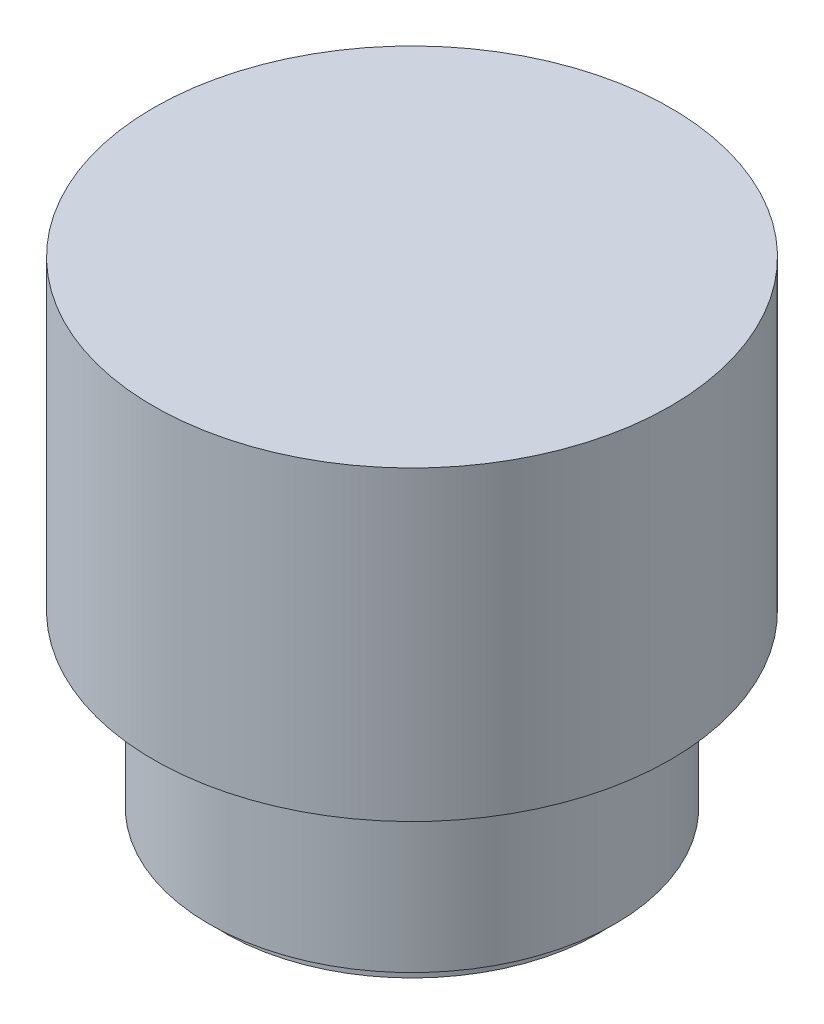
ISO-10303-21;
HEADER;
FILE_DESCRIPTION(('STEP AP214'),'2;1');
FILE_NAME('part.step','',(''),(''),'','','');
FILE_SCHEMA(('AUTOMOTIVE_DESIGN { 1 0 10303 214 1 1 1 1 }'));
ENDSEC;
DATA;
#1=APPLICATION_CONTEXT('core data for automotive mechanical design processes');
#2=APPLICATION_PROTOCOL_DEFINITION('international standard','automotive_design',2000,#1);
#3=PRODUCT_CONTEXT('',#1,'mechanical');
#4=PRODUCT('Part','Part','',(#3));
#5=PRODUCT_RELATED_PRODUCT_CATEGORY('part','',(#4));
#6=PRODUCT_DEFINITION_FORMATION('','',#4);
#7=PRODUCT_DEFINITION_CONTEXT('part definition',#1,'design');
#8=PRODUCT_DEFINITION('design','',#6,#7);
#9=PRODUCT_DEFINITION_SHAPE('','',#8);
#10=(LENGTH_UNIT() NAMED_UNIT(*) SI_UNIT(.MILLI.,.METRE.));
#11=(NAMED_UNIT(*) PLANE_ANGLE_UNIT() SI_UNIT($,.RADIAN.));
#12=(NAMED_UNIT(*) SI_UNIT($,.STERADIAN.) SOLID_ANGLE_UNIT());
#13=UNCERTAINTY_MEASURE_WITH_UNIT(LENGTH_MEASURE(1.E-05),#10,'distance_accuracy_value','');
#14=(GEOMETRIC_REPRESENTATION_CONTEXT(3) GLOBAL_UNCERTAINTY_ASSIGNED_CONTEXT((#13)) GLOBAL_UNIT_ASSIGNED_CONTEXT((#10,
#11,#12)) REPRESENTATION_CONTEXT('',''));
#15=CARTESIAN_POINT('',(0.,0.,0.));
#16=DIRECTION('',(0.,0.,1.));
#17=DIRECTION('',(1.,0.,0.));
#18=AXIS2_PLACEMENT_3D('',#15,#16,#17);
#19=CARTESIAN_POINT('',(1.46158824139451E-12,-426.088089193896,0.));
#20=DIRECTION('',(0.,-1.,0.));
#21=DIRECTION('',(1.,0.,0.));
#22=AXIS2_PLACEMENT_3D('',#19,#20,#21);
#23=CYLINDRICAL_SURFACE('',#22,32.4999999999999);
#24=CARTESIAN_POINT('',(0.,23.4000000000001,0.));
#25=DIRECTION('',(0.,-1.,0.));
#26=DIRECTION('',(1.,0.,0.));
#27=AXIS2_PLACEMENT_3D('',#24,#25,#26);
#28=CIRCLE('',#27,32.4999999999999);
#29=CARTESIAN_POINT('',(32.4999999999998,23.4000000000002,0.));
#30=VERTEX_POINT('',#29);
#31=EDGE_CURVE('E103',#30,#30,#28,.T.);
#32=ORIENTED_EDGE('',*,*,#31,.F.);
#33=EDGE_LOOP('',(#32));
#34=FACE_BOUND('',#33,.T.);
#35=CARTESIAN_POINT('',(-2.12332413031029E-13,61.9000000000001,0.));
#36=DIRECTION('',(0.,-1.,0.));
#37=DIRECTION('',(1.,0.,0.));
#38=AXIS2_PLACEMENT_3D('',#35,#36,#37);
#39=CIRCLE('',#38,32.4999999999998);
#40=CARTESIAN_POINT('',(32.4999999999996,61.9000000000002,0.));
#41=VERTEX_POINT('',#40);
#42=EDGE_CURVE('E66',#41,#41,#39,.T.);
#43=ORIENTED_EDGE('',*,*,#42,.T.);
#44=EDGE_LOOP('',(#43));
#45=FACE_BOUND('',#44,.T.);
#46=CARTESIAN_POINT('',(9.10117987628585,36.8180469600175,-31.1996565027216));
#47=CARTESIAN_POINT('',(8.97444744300858,36.93689250463,-31.2366255768154));
#48=CARTESIAN_POINT('',(8.85222350861118,37.0611947221042,-31.2714399523793));
#49=CARTESIAN_POINT('',(8.61781792393339,37.3199558743392,-31.3368474571301));
#50=CARTESIAN_POINT('',(8.50563535881718,37.4544138817775,-31.3674409710036));
#51=CARTESIAN_POINT('',(8.2923018195085,37.7325723004786,-31.4245115913373));
#52=CARTESIAN_POINT('',(8.19114782497271,37.8762701640397,-31.4509898256796));
#53=CARTESIAN_POINT('',(8.00069997574731,38.1719711506832,-31.4999757332363));
#54=CARTESIAN_POINT('',(7.91140649361161,38.3239745344411,-31.5224832817336));
#55=CARTESIAN_POINT('',(7.7454175129535,38.635278561517,-31.5636789254559));
#56=CARTESIAN_POINT('',(7.66872660868346,38.7945818390562,-31.5823656284006));
#57=CARTESIAN_POINT('',(7.52860910310954,39.1193616261684,-31.6160598841845));
#58=CARTESIAN_POINT('',(7.46518717311381,39.2848402856908,-31.6310661416515));
#59=CARTESIAN_POINT('',(7.35219263638669,39.6206838196618,-31.657520946223));
#60=CARTESIAN_POINT('',(7.30261607492916,39.7910472834754,-31.6689705093503));
#61=CARTESIAN_POINT('',(7.21768681925356,40.1355431594629,-31.688434771072));
#62=CARTESIAN_POINT('',(7.18233937913161,40.3096769388598,-31.6964482009471));
#63=CARTESIAN_POINT('',(7.12639458710702,40.659103950691,-31.7090731068646));
#64=CARTESIAN_POINT('',(7.10569072701656,40.8343792528021,-31.7137091554229));
#65=CARTESIAN_POINT('',(7.07877688045605,41.1861599354662,-31.7197274430876));
#66=CARTESIAN_POINT('',(7.07257222384551,41.3626657444438,-31.7211084856661));
#67=CARTESIAN_POINT('',(7.07472249739101,41.7155139122924,-31.7206289764132));
#68=CARTESIAN_POINT('',(7.08307164575726,41.8918563082383,-31.7187697118585));
#69=CARTESIAN_POINT('',(7.11425633850161,42.2432562577674,-31.7117897852069));
#70=CARTESIAN_POINT('',(7.13709722667269,42.4183133132865,-31.7066679200313));
#71=CARTESIAN_POINT('',(7.19703102638054,42.7655210520723,-31.6931173101599));
#72=CARTESIAN_POINT('',(7.23409867784785,42.9376763251864,-31.6846944259715));
#73=CARTESIAN_POINT('',(7.32220201048479,43.2782383297093,-31.6644500850102));
#74=CARTESIAN_POINT('',(7.37324282316261,43.4466436593714,-31.6526273796053));
#75=CARTESIAN_POINT('',(7.48885337120653,43.7784105051804,-31.6254738633815));
#76=CARTESIAN_POINT('',(7.55342007732233,43.9417731413024,-31.6101438379889));
#77=CARTESIAN_POINT('',(7.69555481950386,44.262347264277,-31.5758416699004));
#78=CARTESIAN_POINT('',(7.77312310219462,44.4195586343774,-31.5568694581155));
#79=CARTESIAN_POINT('',(7.94071034284731,44.7269134809781,-31.5151167042173));
#80=CARTESIAN_POINT('',(8.03074391426727,44.8770483804719,-31.4923316855898));
#81=CARTESIAN_POINT('',(8.22243328886289,45.1690235694564,-31.4428272544223));
#82=CARTESIAN_POINT('',(8.32408934266214,45.3108636799813,-31.416107757037));
#83=CARTESIAN_POINT('',(8.53813783152335,45.5852683016831,-31.3586108400308));
#84=CARTESIAN_POINT('',(8.65052793665023,45.7178348150146,-31.3278343004832));
#85=CARTESIAN_POINT('',(8.88514772308753,45.9729178764235,-31.262101625041));
#86=CARTESIAN_POINT('',(9.00738081664156,46.0954309093111,-31.2271440376575));
#87=CARTESIAN_POINT('',(9.26173424177217,46.3306343180416,-31.1526558648121));
#88=CARTESIAN_POINT('',(9.39393111464588,46.4432303114029,-31.1130882555695));
#89=CARTESIAN_POINT('',(9.66614925046855,46.6567769543581,-31.029597046263));
#90=CARTESIAN_POINT('',(9.80617334163058,46.7577233536935,-30.9856718671766));
#91=CARTESIAN_POINT('',(10.236175688983,47.0421872451383,-30.8473812818754));
#92=CARTESIAN_POINT('',(10.5363270512732,47.2075524351679,-30.7464309535408));
#93=CARTESIAN_POINT('',(11.1636007737478,47.4913407225581,-30.524387909662));
#94=CARTESIAN_POINT('',(11.4912788834145,47.6080920977422,-30.4027539534866));
#95=CARTESIAN_POINT('',(12.1551665942238,47.7865521211756,-30.143473148644));
#96=CARTESIAN_POINT('',(12.4913785906279,47.8482451361474,-30.0058217645196));
#97=CARTESIAN_POINT('',(13.1864690142337,47.9201782430032,-29.7072316946603));
#98=CARTESIAN_POINT('',(13.5453286224954,47.9266200600769,-29.5453448962397));
#99=CARTESIAN_POINT('',(14.2538201695698,47.8809674124038,-29.2101427333456));
#100=CARTESIAN_POINT('',(14.6034488582112,47.8288526041511,-29.0368234167293));
#101=CARTESIAN_POINT('',(15.3178990517199,47.6620227406197,-28.6668524210239));
#102=CARTESIAN_POINT('',(15.6811172434653,47.5419447806753,-28.4695284989743));
#103=CARTESIAN_POINT('',(16.3803386185783,47.2396883772011,-28.0730488032478));
#104=CARTESIAN_POINT('',(16.7163159491102,47.0574517766855,-27.8738914846157));
#105=CARTESIAN_POINT('',(17.2038188353936,46.7335800596709,-27.5738722660336));
#106=CARTESIAN_POINT('',(17.3680867621788,46.6128516006034,-27.4706242498508));
#107=CARTESIAN_POINT('',(17.685613586375,46.3551593831893,-27.2672793622561));
#108=CARTESIAN_POINT('',(17.8388709331128,46.2181933451965,-27.1671829358086));
#109=CARTESIAN_POINT('',(18.132827956206,45.9286633337795,-26.9718683948192));
#110=CARTESIAN_POINT('',(18.2735431098438,45.7761190975251,-26.8766443313149));
#111=CARTESIAN_POINT('',(18.5412217770455,45.4557132683328,-26.6926853856316));
#112=CARTESIAN_POINT('',(18.6681849479137,45.2878512938731,-26.6039506651833));
#113=CARTESIAN_POINT('',(18.8755679180079,44.9831990139066,-26.4570336407738));
#114=CARTESIAN_POINT('',(18.9594936319927,44.849713976104,-26.3969162964246));
#115=CARTESIAN_POINT('',(19.1181717361683,44.5751211291077,-26.2822199921765));
#116=CARTESIAN_POINT('',(19.1929252929408,44.4340142926045,-26.2276403281085));
#117=CARTESIAN_POINT('',(19.3324435866102,44.1447454215847,-26.1249713822805));
#118=CARTESIAN_POINT('',(19.3972126649587,43.9965864903464,-26.0768792807408));
#119=CARTESIAN_POINT('',(19.5159636027411,43.6939127246837,-25.9881254034378));
#120=CARTESIAN_POINT('',(19.5699499809814,43.5394005856322,-25.9474605156967));
#121=CARTESIAN_POINT('',(19.6667831003705,43.2235401530755,-25.8741447999619));
#122=CARTESIAN_POINT('',(19.7095310805481,43.0621448552095,-25.8415651548093));
#123=CARTESIAN_POINT('',(19.7825407758475,42.7349588328811,-25.7857169786996));
#124=CARTESIAN_POINT('',(19.8128025071016,42.5691681140978,-25.7624484357126));
#125=CARTESIAN_POINT('',(19.8602404133081,42.2347472410947,-25.7258965117535));
#126=CARTESIAN_POINT('',(19.8774256752706,42.06611914205,-25.7126061968653));
#127=CARTESIAN_POINT('',(19.8983859373248,41.7275440043896,-25.6963892278707));
#128=CARTESIAN_POINT('',(19.9021627244449,41.5575971445589,-25.6934611927208));
#129=CARTESIAN_POINT('',(19.8966269517706,41.2405179373246,-25.6977476327738));
#130=CARTESIAN_POINT('',(19.8889762493992,41.0933349919917,-25.7036744151371));
#131=CARTESIAN_POINT('',(19.863640414715,40.8003036144781,-25.7232588821961));
#132=CARTESIAN_POINT('',(19.8459520012046,40.6544556345293,-25.7369190948465));
#133=CARTESIAN_POINT('',(19.8008161571051,40.3652305012136,-25.7716605264529));
#134=CARTESIAN_POINT('',(19.7733717384707,40.2218525995714,-25.7927394550216));
#135=CARTESIAN_POINT('',(19.7091047924332,39.9383854770602,-25.8418811690475));
#136=CARTESIAN_POINT('',(19.6722785753713,39.7982975738051,-25.869946702086));
#137=CARTESIAN_POINT('',(19.5898813839814,39.5227570448847,-25.9323968298029));
#138=CARTESIAN_POINT('',(19.5443431475028,39.3872892351733,-25.96675774797));
#139=CARTESIAN_POINT('',(19.4449535460247,39.1210573673073,-26.0412680110076));
#140=CARTESIAN_POINT('',(19.3910993080386,38.9902949540824,-26.0814193560189));
#141=CARTESIAN_POINT('',(19.2178812889262,38.6059073750145,-26.2096100888348));
#142=CARTESIAN_POINT('',(19.0868161888375,38.3600306172682,-26.3054215208735));
#143=CARTESIAN_POINT('',(18.7759678438656,37.8567447690408,-26.5283770221575));
#144=CARTESIAN_POINT('',(18.5918173899942,37.6031949427275,-26.658067508661));
#145=CARTESIAN_POINT('',(18.1933575286559,37.1296835657968,-26.9315854702993));
#146=CARTESIAN_POINT('',(17.9790278282945,36.9097448249152,-27.0754224379156));
#147=CARTESIAN_POINT('',(17.480813995396,36.4658858925866,-27.400280487229));
#148=CARTESIAN_POINT('',(17.1914834254492,36.2493527106216,-27.5831287004829));
#149=CARTESIAN_POINT('',(16.7352784511077,35.9638848509403,-27.8605894720859));
#150=CARTESIAN_POINT('',(16.5794004616165,35.8752395835445,-27.9536691113747));
#151=CARTESIAN_POINT('',(16.2608573583729,35.7113300796705,-28.1401582343843));
#152=CARTESIAN_POINT('',(16.0981913168275,35.6360676798116,-28.2335677615868));
#153=CARTESIAN_POINT('',(15.7471387087848,35.4911860626901,-28.4310196911723));
#154=CARTESIAN_POINT('',(15.5579978773939,35.423309536375,-28.5350019905775));
#155=CARTESIAN_POINT('',(15.1734403678021,35.3054353298035,-28.741334339456));
#156=CARTESIAN_POINT('',(14.9780257465319,35.2554318536099,-28.8436849077679));
#157=CARTESIAN_POINT('',(14.5819920201288,35.1738763690747,-29.0459113047071));
#158=CARTESIAN_POINT('',(14.3813703791516,35.1423335341774,-29.1457858794005));
#159=CARTESIAN_POINT('',(13.9764853204655,35.0983876218073,-29.342093378939));
#160=CARTESIAN_POINT('',(13.7722236897877,35.0859754006292,-29.4385279264422));
#161=CARTESIAN_POINT('',(13.364213844962,35.0809059960894,-29.6259602775505));
#162=CARTESIAN_POINT('',(13.1604941941193,35.0879912071229,-29.7170128946352));
#163=CARTESIAN_POINT('',(12.7526856099574,35.1218715825038,-29.8942873131116));
#164=CARTESIAN_POINT('',(12.5485968911733,35.148657623651,-29.9805113306826));
#165=CARTESIAN_POINT('',(12.1418387078521,35.2223047807746,-30.1475386121774));
#166=CARTESIAN_POINT('',(11.9391690830832,35.2691635919089,-30.2283424972326));
#167=CARTESIAN_POINT('',(11.5372692342153,35.3831461157791,-30.3840064420358));
#168=CARTESIAN_POINT('',(11.3380387452308,35.4502682603855,-30.4588669611604));
#169=CARTESIAN_POINT('',(10.9564373839669,35.6002982064421,-30.5981267004246));
#170=CARTESIAN_POINT('',(10.7737539955494,35.6820834409493,-30.6628793763939));
#171=CARTESIAN_POINT('',(10.4152931649866,35.8633290289625,-30.7864841714398));
#172=CARTESIAN_POINT('',(10.2395150821195,35.9627877378496,-30.8453368387499));
#173=CARTESIAN_POINT('',(9.89689059993786,36.1787876746883,-30.9569702881595));
#174=CARTESIAN_POINT('',(9.73003914082881,36.2953190823852,-31.0097545298874));
#175=CARTESIAN_POINT('',(9.4070863197293,36.5447094947973,-31.1092476281227));
#176=CARTESIAN_POINT('',(9.25098338910133,36.6775661091017,-31.1559573720289));
#177=CARTESIAN_POINT('',(9.10117987628585,36.8180469600175,-31.1996565027216));
#178=B_SPLINE_CURVE_WITH_KNOTS('',3,(#46,#47,#48,#49,#50,#51,#52,#53,#54,#55,#56,#57,#58,#59,
#60,#61,#62,#63,#64,#65,#66,#67,#68,#69,#70,#71,#72,#73,#74,#75,#76,#77,#78,#79,#80,#81,#82,#83,
#84,#85,#86,#87,#88,#89,#90,#91,#92,#93,#94,#95,#96,#97,#98,#99,#100,#101,#102,#103,#104,#105,
#106,#107,#108,#109,#110,#111,#112,#113,#114,#115,#116,#117,#118,#119,#120,#121,#122,#123,#124,
#125,#126,#127,#128,#129,#130,#131,#132,#133,#134,#135,#136,#137,#138,#139,#140,#141,#142,#143,
#144,#145,#146,#147,#148,#149,#150,#151,#152,#153,#154,#155,#156,#157,#158,#159,#160,#161,#162,
#163,#164,#165,#166,#167,#168,#169,#170,#171,#172,#173,#174,#175,#176,#177),.UNSPECIFIED.,.T.,
.F.,(4,2,2,2,2,2,2,2,2,2,2,2,2,2,2,2,2,2,2,2,2,2,2,2,2,2,2,2,2,2,2,2,2,2,2,2,2,2,2,2,2,2,2,2,2,
2,2,2,2,2,2,2,2,2,2,2,2,2,2,2,2,2,2,2,2,4),(0.,0.53270638269816,1.06536418278136,
1.59787573796985,2.13040401607525,2.66312599802166,3.19603520895793,3.72879204615633,
4.26174542350739,4.79078142138877,5.32001186059185,5.84903210034303,6.37824752845771,
6.90652763247895,7.43500200310733,7.96335814325089,8.49172430684057,9.02071522029344,
9.5497175428941,10.0786052999989,10.6076772011768,11.1413366373398,11.6751901633063,
12.7418978952845,13.8427447483053,14.9439040765606,16.1202036045731,17.2969119242005,
18.5828722722669,19.8700391084806,20.5548716585551,21.2398004685986,21.9238720115946,
22.6079605975453,23.1137436697559,23.6194623459716,24.1249605015065,24.6302463666732,
25.139834433719,25.6494218423717,26.1586548078241,26.6678199021799,27.1097806623902,
27.551885977137,27.9938549198462,28.4359979484485,28.8765110254432,29.3171766314379,
30.1980266701677,31.2118065399114,32.226271372146,33.4360625904248,34.0417431010974,
34.6475066692694,35.3254938766063,36.003261023913,36.6813646812876,37.3591441303001,
38.0280117141499,38.6965697489227,39.3650510375431,40.0334806072961,40.6636755939139,
41.2938119679297,41.9235872988637,42.5532705248838),.UNSPECIFIED.);
#179=CARTESIAN_POINT('',(9.10117987628585,36.8180469600175,-31.1996565027216));
#180=VERTEX_POINT('',#179);
#181=EDGE_CURVE('E60',#180,#180,#178,.T.);
#182=ORIENTED_EDGE('',*,*,#181,.F.);
#183=EDGE_LOOP('',(#182));
#184=FACE_BOUND('',#183,.T.);
#185=CARTESIAN_POINT('',(-14.918359654621,35.2447403102292,-28.8737345214534));
#186=CARTESIAN_POINT('',(-15.3132716823804,35.3351945435733,-28.6696876665965));
#187=CARTESIAN_POINT('',(-15.6973541967746,35.4625664787659,-28.4609004758644));
#188=CARTESIAN_POINT('',(-16.4348541417601,35.7866396277422,-28.0414993619274));
#189=CARTESIAN_POINT('',(-16.7882344931591,35.9834232588271,-27.8308835587285));
#190=CARTESIAN_POINT('',(-17.2884255716857,36.3276375761989,-27.5208888554561));
#191=CARTESIAN_POINT('',(-17.4504190891538,36.4507933564333,-27.4183808396946));
#192=CARTESIAN_POINT('',(-17.7632529028757,36.7131794302386,-27.2167480136014));
#193=CARTESIAN_POINT('',(-17.914092008369,36.8524114359336,-27.11762356508));
#194=CARTESIAN_POINT('',(-18.2030168188647,37.1462630563832,-26.9245308138772));
#195=CARTESIAN_POINT('',(-18.3411219647663,37.3008584401012,-26.8305547432981));
#196=CARTESIAN_POINT('',(-18.6034155256877,37.6251801721779,-26.6493587721229));
#197=CARTESIAN_POINT('',(-18.7276037562896,37.7949067209916,-26.5621389610612));
#198=CARTESIAN_POINT('',(-18.9294706094327,38.1017993835813,-26.4184817353219));
#199=CARTESIAN_POINT('',(-19.0107490530354,38.2356627689545,-26.3600152806979));
#200=CARTESIAN_POINT('',(-19.1641472803537,38.5107783457665,-26.2487034828072));
#201=CARTESIAN_POINT('',(-19.2362682634256,38.6520295661891,-26.1958574035852));
#202=CARTESIAN_POINT('',(-19.3705528272782,38.9413371598715,-26.0967172642198));
#203=CARTESIAN_POINT('',(-19.4327205673113,39.0893906571404,-26.0504204682145));
#204=CARTESIAN_POINT('',(-19.5463210104728,39.3915821114124,-25.9652917510997));
#205=CARTESIAN_POINT('',(-19.5977581679076,39.5457175120715,-25.9264567331082));
#206=CARTESIAN_POINT('',(-19.689539185451,39.8604820534155,-25.8568249995762));
#207=CARTESIAN_POINT('',(-19.7297885681151,40.0211540965662,-25.8260968484616));
#208=CARTESIAN_POINT('',(-19.7979333607482,40.3465877600961,-25.7738953910574));
#209=CARTESIAN_POINT('',(-19.8258287978702,40.5113493714861,-25.7524220644265));
#210=CARTESIAN_POINT('',(-19.8687176702171,40.8434254946974,-25.7193467092222));
#211=CARTESIAN_POINT('',(-19.8837192035406,41.0107383368931,-25.7077384848601));
#212=CARTESIAN_POINT('',(-19.9005397984048,41.346412453511,-25.6947199746924));
#213=CARTESIAN_POINT('',(-19.9023604766176,41.5147735968205,-25.693308438232));
#214=CARTESIAN_POINT('',(-19.8933992472372,41.8295007147927,-25.7002467244565));
#215=CARTESIAN_POINT('',(-19.8841898838678,41.9759422133131,-25.707378551161));
#216=CARTESIAN_POINT('',(-19.8558498658937,42.2673357965244,-25.7292741461039));
#217=CARTESIAN_POINT('',(-19.8367159565448,42.4122873766847,-25.7440404180451));
#218=CARTESIAN_POINT('',(-19.7888203097924,42.6995948808484,-25.7808746775437));
#219=CARTESIAN_POINT('',(-19.760061413904,42.8419515578623,-25.8029405100826));
#220=CARTESIAN_POINT('',(-19.6933061059144,43.1232787302777,-25.8539253583618));
#221=CARTESIAN_POINT('',(-19.6553060634034,43.2622478712118,-25.882847067339));
#222=CARTESIAN_POINT('',(-19.5703962042832,43.5365012449151,-25.9471083794168));
#223=CARTESIAN_POINT('',(-19.5234538716425,43.6717699027412,-25.9824713831799));
#224=CARTESIAN_POINT('',(-19.4212791535066,43.9374890147592,-26.0589329945138));
#225=CARTESIAN_POINT('',(-19.3660438909809,44.0679377771571,-26.1000335922548));
#226=CARTESIAN_POINT('',(-19.1887259266341,44.4512372412192,-26.2309811278274));
#227=CARTESIAN_POINT('',(-19.0549851043506,44.6961870328063,-26.328509043955));
#228=CARTESIAN_POINT('',(-18.7379815408034,45.1979959439942,-26.5552542102322));
#229=CARTESIAN_POINT('',(-18.5502595040019,45.4508434758901,-26.6870395574147));
#230=CARTESIAN_POINT('',(-18.144635043555,45.9223805651498,-26.9644722046899));
#231=CARTESIAN_POINT('',(-17.9267121828293,46.141046776768,-27.1101288705308));
#232=CARTESIAN_POINT('',(-17.420787416387,46.5813411340133,-27.4385367196427));
#233=CARTESIAN_POINT('',(-17.1273611299032,46.7954932552717,-27.6230443253511));
#234=CARTESIAN_POINT('',(-16.6650954312908,47.0767801733332,-27.9026404481498));
#235=CARTESIAN_POINT('',(-16.5072098910783,47.1639290066634,-27.9963731355057));
#236=CARTESIAN_POINT('',(-16.1846898022378,47.3246292108114,-28.1840477815785));
#237=CARTESIAN_POINT('',(-16.0200543329201,47.3981787190933,-28.27798976718));
#238=CARTESIAN_POINT('',(-15.6656516672382,47.5388838573221,-28.4760102869932));
#239=CARTESIAN_POINT('',(-15.4751674651716,47.6043391405391,-28.5800158954247));
#240=CARTESIAN_POINT('',(-15.0880735898512,47.7172156656637,-28.7862485482602));
#241=CARTESIAN_POINT('',(-14.8914659698271,47.7646428835639,-28.8884761712943));
#242=CARTESIAN_POINT('',(-14.4932190888661,47.8408815281494,-29.0903155029984));
#243=CARTESIAN_POINT('',(-14.2915773626951,47.8696836406185,-29.1899258789606));
#244=CARTESIAN_POINT('',(-13.8848593499326,47.9079834439622,-29.385567411313));
#245=CARTESIAN_POINT('',(-13.6797847760978,47.9174904883893,-29.4816002797752));
#246=CARTESIAN_POINT('',(-13.2713131633672,47.9166304489191,-29.6676882678928));
#247=CARTESIAN_POINT('',(-13.0679499635697,47.9066096392998,-29.7578187735371));
#248=CARTESIAN_POINT('',(-12.6611237049351,47.866896595017,-29.9331752555296));
#249=CARTESIAN_POINT('',(-12.4576607377309,47.8372135929991,-30.0184035133896));
#250=CARTESIAN_POINT('',(-12.052472858487,47.7578450950022,-30.1833684796254));
#251=CARTESIAN_POINT('',(-11.8507474499633,47.7081655204593,-30.2631068055155));
#252=CARTESIAN_POINT('',(-11.4510272116722,47.5886478968946,-30.4166039520466));
#253=CARTESIAN_POINT('',(-11.2530319709302,47.5188120826045,-30.4903634344043));
#254=CARTESIAN_POINT('',(-10.8812522274604,47.3665780782586,-30.6248870036579));
#255=CARTESIAN_POINT('',(-10.7069385783486,47.285972231943,-30.6862211051173));
#256=CARTESIAN_POINT('',(-10.3648488126318,47.1085686444357,-30.8034510045469));
#257=CARTESIAN_POINT('',(-10.1970720597748,47.0117724839648,-30.8593473325855));
#258=CARTESIAN_POINT('',(-9.8698138210931,46.802513181304,-30.9655674756129));
#259=CARTESIAN_POINT('',(-9.7103292661441,46.6900558931527,-31.0158933602433));
#260=CARTESIAN_POINT('',(-9.401274736901,46.4501563714049,-31.1109655047651));
#261=CARTESIAN_POINT('',(-9.25170416276523,46.3227150457085,-31.1557121023737));
#262=CARTESIAN_POINT('',(-8.97574200087384,46.0646687211155,-31.2362773755264));
#263=CARTESIAN_POINT('',(-8.84845417214874,45.9351543929586,-31.2725255080984));
#264=CARTESIAN_POINT('',(-8.60479859457528,45.6651256973228,-31.3404441377122));
#265=CARTESIAN_POINT('',(-8.48843018728919,45.5246119940413,-31.3721149108295));
#266=CARTESIAN_POINT('',(-8.26771448186352,45.2336062784884,-31.4310029721574));
#267=CARTESIAN_POINT('',(-8.16336510282171,45.0831160006312,-31.4582210316279));
#268=CARTESIAN_POINT('',(-7.96763570323607,44.7732468062661,-31.5083638606513));
#269=CARTESIAN_POINT('',(-7.87625552152172,44.6138680002518,-31.5312886835579));
#270=CARTESIAN_POINT('',(-7.71043791933637,44.2934741651131,-31.5722373485569));
#271=CARTESIAN_POINT('',(-7.6354989207554,44.1327375960514,-31.5904110784614));
#272=CARTESIAN_POINT('',(-7.49904822726651,43.8052350337124,-31.6230802238779));
#273=CARTESIAN_POINT('',(-7.43754107388614,43.6384670232525,-31.637574395539));
#274=CARTESIAN_POINT('',(-7.32853125276595,43.3002289618927,-31.663003076084));
#275=CARTESIAN_POINT('',(-7.28102273440398,43.1287609081843,-31.6739390722796));
#276=CARTESIAN_POINT('',(-7.20035902328735,42.7822324827346,-31.6923736056298));
#277=CARTESIAN_POINT('',(-7.16720912254466,42.6071708113849,-31.6998708754674));
#278=CARTESIAN_POINT('',(-7.11582480947421,42.2565646960081,-31.7114446901164));
#279=CARTESIAN_POINT('',(-7.09744356442082,42.0810428642963,-31.7155549202949));
#280=CARTESIAN_POINT('',(-7.07518771153792,41.7289709263943,-31.7205272626422));
#281=CARTESIAN_POINT('',(-7.07131842104156,41.5524204670307,-31.721388184231));
#282=CARTESIAN_POINT('',(-7.07813146329674,41.1996826663524,-31.7198686455598));
#283=CARTESIAN_POINT('',(-7.08880820376223,41.0234952115551,-31.7174894309847));
#284=CARTESIAN_POINT('',(-7.12462331524371,40.6726055430201,-31.7094635500456));
#285=CARTESIAN_POINT('',(-7.14976701968403,40.4979039011626,-31.7038156786465));
#286=CARTESIAN_POINT('',(-7.21426205234858,40.1515814195084,-31.6892018298067));
#287=CARTESIAN_POINT('',(-7.2535900212167,39.9799559986135,-31.6802413072019));
#288=CARTESIAN_POINT('',(-7.3461553122206,39.6406472482361,-31.6589048521924));
#289=CARTESIAN_POINT('',(-7.39939774349487,39.472965391461,-31.6465276651564));
#290=CARTESIAN_POINT('',(-7.51933281829213,39.1428328148114,-31.6182451442178));
#291=CARTESIAN_POINT('',(-7.58602245095779,38.9803809333598,-31.6023406000187));
#292=CARTESIAN_POINT('',(-7.73230654295485,38.661807855081,-31.5668670635372));
#293=CARTESIAN_POINT('',(-7.81190125121632,38.5056867804433,-31.5472980005676));
#294=CARTESIAN_POINT('',(-7.98344145610028,38.2006619575595,-31.5043248870337));
#295=CARTESIAN_POINT('',(-8.07540316095029,38.051768035783,-31.480915794711));
#296=CARTESIAN_POINT('',(-8.27082051132151,37.7624350625222,-31.4301402420223));
#297=CARTESIAN_POINT('',(-8.37427640515009,37.6219961937924,-31.4027736961602));
#298=CARTESIAN_POINT('',(-8.59177956147944,37.3505404817364,-31.3439628338054));
#299=CARTESIAN_POINT('',(-8.70582447240512,37.219521557872,-31.3125194220782));
#300=CARTESIAN_POINT('',(-8.94359650792075,36.9676636989892,-31.2454372186571));
#301=CARTESIAN_POINT('',(-9.06732699049068,36.8468283250205,-31.2097969697443));
#302=CARTESIAN_POINT('',(-9.32459092130859,36.6150411796742,-31.1339064540289));
#303=CARTESIAN_POINT('',(-9.45820437088138,36.5041910264223,-31.0936166410397));
#304=CARTESIAN_POINT('',(-9.7330836011076,36.2942425145627,-31.0086737033971));
#305=CARTESIAN_POINT('',(-9.87435214962766,36.1951484484856,-30.9640189957668));
#306=CARTESIAN_POINT('',(-10.3078282180572,35.9163625195484,-30.8235380296771));
#307=CARTESIAN_POINT('',(-10.6099413702143,35.7549566661324,-30.7211267749519));
#308=CARTESIAN_POINT('',(-11.2408735572552,35.4792132657574,-30.4960441082913));
#309=CARTESIAN_POINT('',(-11.5702472139479,35.366624945441,-30.3728109289981));
#310=CARTESIAN_POINT('',(-12.2367673105975,35.1966824635171,-30.1104599765862));
#311=CARTESIAN_POINT('',(-12.5739147933922,35.1393357570833,-29.9713400622942));
#312=CARTESIAN_POINT('',(-13.2510639336603,35.0781599742244,-29.6782239895987));
#313=CARTESIAN_POINT('',(-13.5910543800303,35.0749476908478,-29.5240764844656));
#314=CARTESIAN_POINT('',(-14.2625854691833,35.1210941694987,-29.2055987004413));
#315=CARTESIAN_POINT('',(-14.5941226502816,35.1704741253886,-29.0412643415479));
#316=CARTESIAN_POINT('',(-14.918359654621,35.2447403102292,-28.8737345214534));
#317=B_SPLINE_CURVE_WITH_KNOTS('',3,(#185,#186,#187,#188,#189,#190,#191,#192,#193,#194,#195,
#196,#197,#198,#199,#200,#201,#202,#203,#204,#205,#206,#207,#208,#209,#210,#211,#212,#213,#214,
#215,#216,#217,#218,#219,#220,#221,#222,#223,#224,#225,#226,#227,#228,#229,#230,#231,#232,#233,
#234,#235,#236,#237,#238,#239,#240,#241,#242,#243,#244,#245,#246,#247,#248,#249,#250,#251,#252,
#253,#254,#255,#256,#257,#258,#259,#260,#261,#262,#263,#264,#265,#266,#267,#268,#269,#270,#271,
#272,#273,#274,#275,#276,#277,#278,#279,#280,#281,#282,#283,#284,#285,#286,#287,#288,#289,#290,
#291,#292,#293,#294,#295,#296,#297,#298,#299,#300,#301,#302,#303,#304,#305,#306,#307,#308,#309,
#310,#311,#312,#313,#314,#315,#316),.UNSPECIFIED.,.T.,.F.,(4,2,2,2,2,2,2,2,2,2,2,2,2,2,2,2,2,2,
2,2,2,2,2,2,2,2,2,2,2,2,2,2,2,2,2,2,2,2,2,2,2,2,2,2,2,2,2,2,2,2,2,2,2,2,2,2,2,2,2,2,2,2,2,2,2,
4),(0.,1.35956975563032,2.72075928680869,3.40361674895086,4.08654700287029,4.76841674041007,
5.45029551257462,5.95133159662929,6.45230199195852,6.95306249272541,7.45361471043075,
7.95827371112024,8.46293160260957,8.96727230840584,9.47155115423182,9.91172919880049,
10.3520516906348,10.7922443037475,11.2326101278865,11.6746088826877,12.116761334068,
13.0005999406375,14.0210548699106,15.0422037501315,16.2592089465236,16.8685000037005,
17.4778744464369,18.1571269790982,18.8361541545111,19.5155206420869,20.1945577185756,
20.8616633937817,21.5284560424285,22.1950513838188,22.8615728478413,23.4655863727239,
24.0695409598917,24.6732703952789,25.2769632688377,25.8318008846249,26.386605022347,
26.9413129597722,27.4960140031399,28.0302022530217,28.5645708420326,29.0987157779733,
29.6330574112006,30.1620183997093,30.6911731861766,31.2201245941385,31.7492711316084,
32.2775501936267,32.8060235033447,33.3343786178804,33.8627439252369,34.3918085841988,
34.9208846746946,35.4498435494124,35.9789866329692,36.51301799432,37.0472437516652,
38.1147385891403,39.2178339992238,40.3210782575348,41.4368841923945,42.5531399500556),.UNSPECIFIED.);
#318=CARTESIAN_POINT('',(-14.918359654621,35.2447403102292,-28.8737345214534));
#319=VERTEX_POINT('',#318);
#320=EDGE_CURVE('E43',#319,#319,#317,.T.);
#321=ORIENTED_EDGE('',*,*,#320,.F.);
#322=EDGE_LOOP('',(#321));
#323=FACE_BOUND('',#322,.T.);
#324=ADVANCED_FACE('F39',(#34,#45,#184,#323),#23,.T.);
#325=CARTESIAN_POINT('',(0.,0.,0.));
#326=DIRECTION('',(0.,1.,0.));
#327=DIRECTION('',(-1.,0.,0.));
#328=AXIS2_PLACEMENT_3D('',#325,#326,#327);
#329=PLANE('',#328);
#330=CARTESIAN_POINT('',(15.,0.,15.));
#331=DIRECTION('',(0.,-1.,0.));
#332=DIRECTION('',(1.,0.,0.));
#333=AXIS2_PLACEMENT_3D('',#330,#331,#332);
#334=CIRCLE('',#333,1.25);
#335=CARTESIAN_POINT('',(16.25,0.,15.));
#336=VERTEX_POINT('',#335);
#337=EDGE_CURVE('E287',#336,#336,#334,.T.);
#338=ORIENTED_EDGE('',*,*,#337,.F.);
#339=EDGE_LOOP('',(#338));
#340=FACE_BOUND('',#339,.T.);
#341=CARTESIAN_POINT('',(15.,0.,-15.));
#342=DIRECTION('',(0.,-1.,0.));
#343=DIRECTION('',(1.,0.,0.));
#344=AXIS2_PLACEMENT_3D('',#341,#342,#343);
#345=CIRCLE('',#344,1.25);
#346=CARTESIAN_POINT('',(16.25,0.,-15.));
#347=VERTEX_POINT('',#346);
#348=EDGE_CURVE('E295',#347,#347,#345,.T.);
#349=ORIENTED_EDGE('',*,*,#348,.F.);
#350=EDGE_LOOP('',(#349));
#351=FACE_BOUND('',#350,.T.);
#352=CARTESIAN_POINT('',(-15.,0.,-15.));
#353=DIRECTION('',(0.,-1.,0.));
#354=DIRECTION('',(1.,0.,0.));
#355=AXIS2_PLACEMENT_3D('',#352,#353,#354);
#356=CIRCLE('',#355,1.25);
#357=CARTESIAN_POINT('',(-13.75,0.,-15.));
#358=VERTEX_POINT('',#357);
#359=EDGE_CURVE('E301',#358,#358,#356,.T.);
#360=ORIENTED_EDGE('',*,*,#359,.F.);
#361=EDGE_LOOP('',(#360));
#362=FACE_BOUND('',#361,.T.);
#363=CARTESIAN_POINT('',(-15.,0.,15.));
#364=DIRECTION('',(0.,-1.,0.));
#365=DIRECTION('',(1.,0.,0.));
#366=AXIS2_PLACEMENT_3D('',#363,#364,#365);
#367=CIRCLE('',#366,1.25);
#368=CARTESIAN_POINT('',(-13.75,0.,15.));
#369=VERTEX_POINT('',#368);
#370=EDGE_CURVE('E120',#369,#369,#367,.T.);
#371=ORIENTED_EDGE('',*,*,#370,.F.);
#372=EDGE_LOOP('',(#371));
#373=FACE_BOUND('',#372,.T.);
#374=CARTESIAN_POINT('',(0.,0.,0.));
#375=DIRECTION('',(0.,-1.,0.));
#376=DIRECTION('',(1.,0.,0.));
#377=AXIS2_PLACEMENT_3D('',#374,#375,#376);
#378=CIRCLE('',#377,23.5);
#379=CARTESIAN_POINT('',(23.5,1.36122002705073E-13,0.));
#380=VERTEX_POINT('',#379);
#381=EDGE_CURVE('E10',#380,#380,#378,.T.);
#382=ORIENTED_EDGE('',*,*,#381,.T.);
#383=EDGE_LOOP('',(#382));
#384=FACE_BOUND('',#383,.T.);
#385=ADVANCED_FACE('F41',(#340,#351,#362,#373,#384),#329,.F.);
#386=CARTESIAN_POINT('',(1.46158824139451E-12,-426.088089193896,0.));
#387=DIRECTION('',(0.,-1.,0.));
#388=DIRECTION('',(1.,0.,0.));
#389=AXIS2_PLACEMENT_3D('',#386,#387,#388);
#390=CYLINDRICAL_SURFACE('',#389,23.5);
#391=ORIENTED_EDGE('',*,*,#381,.F.);
#392=EDGE_LOOP('',(#391));
#393=FACE_BOUND('',#392,.T.);
#394=CARTESIAN_POINT('',(0.,2.00000000000006,0.));
#395=DIRECTION('',(0.,-1.,0.));
#396=DIRECTION('',(1.,0.,0.));
#397=AXIS2_PLACEMENT_3D('',#394,#395,#396);
#398=CIRCLE('',#397,23.5);
#399=CARTESIAN_POINT('',(23.5,2.00000000000014,0.));
#400=VERTEX_POINT('',#399);
#401=EDGE_CURVE('E52',#400,#400,#398,.T.);
#402=ORIENTED_EDGE('',*,*,#401,.T.);
#403=EDGE_LOOP('',(#402));
#404=FACE_BOUND('',#403,.T.);
#405=ADVANCED_FACE('F98',(#393,#404),#390,.T.);
#406=CARTESIAN_POINT('',(-23.5,2.,0.));
#407=DIRECTION('',(0.,1.,0.));
#408=DIRECTION('',(-1.,0.,0.));
#409=AXIS2_PLACEMENT_3D('',#406,#407,#408);
#410=PLANE('',#409);
#411=ORIENTED_EDGE('',*,*,#401,.F.);
#412=EDGE_LOOP('',(#411));
#413=FACE_BOUND('',#412,.T.);
#414=CARTESIAN_POINT('',(0.,2.00000000000011,0.));
#415=DIRECTION('',(0.,-1.,0.));
#416=DIRECTION('',(1.,0.,0.));
#417=AXIS2_PLACEMENT_3D('',#414,#415,#416);
#418=CIRCLE('',#417,25.5);
#419=CARTESIAN_POINT('',(25.5,2.0000000000002,0.));
#420=VERTEX_POINT('',#419);
#421=EDGE_CURVE('E57',#420,#420,#418,.T.);
#422=ORIENTED_EDGE('',*,*,#421,.T.);
#423=EDGE_LOOP('',(#422));
#424=FACE_BOUND('',#423,.T.);
#425=ADVANCED_FACE('F131',(#413,#424),#410,.F.);
#426=CARTESIAN_POINT('',(1.46158824139451E-12,-426.088089193896,0.));
#427=DIRECTION('',(0.,-1.,0.));
#428=DIRECTION('',(1.,0.,0.));
#429=AXIS2_PLACEMENT_3D('',#426,#427,#428);
#430=CYLINDRICAL_SURFACE('',#429,25.5);
#431=ORIENTED_EDGE('',*,*,#421,.F.);
#432=EDGE_LOOP('',(#431));
#433=FACE_BOUND('',#432,.T.);
#434=CARTESIAN_POINT('',(0.,23.4000000000001,0.));
#435=DIRECTION('',(0.,-1.,0.));
#436=DIRECTION('',(1.,0.,0.));
#437=AXIS2_PLACEMENT_3D('',#434,#435,#436);
#438=CIRCLE('',#437,25.4999999999999);
#439=CARTESIAN_POINT('',(25.4999999999998,23.4000000000002,0.));
#440=VERTEX_POINT('',#439);
#441=EDGE_CURVE('E126',#440,#440,#438,.T.);
#442=ORIENTED_EDGE('',*,*,#441,.T.);
#443=EDGE_LOOP('',(#442));
#444=FACE_BOUND('',#443,.T.);
#445=ADVANCED_FACE('F89',(#433,#444),#430,.T.);
#446=CARTESIAN_POINT('',(-25.5,23.4,0.));
#447=DIRECTION('',(0.,1.,0.));
#448=DIRECTION('',(-1.,0.,0.));
#449=AXIS2_PLACEMENT_3D('',#446,#447,#448);
#450=PLANE('',#449);
#451=ORIENTED_EDGE('',*,*,#441,.F.);
#452=EDGE_LOOP('',(#451));
#453=FACE_BOUND('',#452,.T.);
#454=ORIENTED_EDGE('',*,*,#31,.T.);
#455=EDGE_LOOP('',(#454));
#456=FACE_BOUND('',#455,.T.);
#457=ADVANCED_FACE('F84',(#453,#456),#450,.F.);
#458=CARTESIAN_POINT('',(-32.5,61.8999999999999,0.));
#459=DIRECTION('',(0.,-1.,0.));
#460=DIRECTION('',(1.,0.,0.));
#461=AXIS2_PLACEMENT_3D('',#458,#459,#460);
#462=PLANE('',#461);
#463=ORIENTED_EDGE('',*,*,#42,.F.);
#464=EDGE_LOOP('',(#463));
#465=FACE_BOUND('',#464,.T.);
#466=ADVANCED_FACE('F77',(#465),#462,.F.);
#467=CARTESIAN_POINT('',(13.4999999999999,41.5000000000001,-32.5));
#468=DIRECTION('',(0.,0.,-1.));
#469=DIRECTION('',(-1.,0.,0.));
#470=AXIS2_PLACEMENT_3D('',#467,#468,#469);
#471=CONICAL_SURFACE('',#470,6.42987114787033,0.00436332312997903);
#472=CARTESIAN_POINT('',(13.4999999999999,41.5000000000001,-14.1949974566546));
#473=DIRECTION('',(0.,0.,1.));
#474=DIRECTION('',(1.,0.,0.));
#475=AXIS2_PLACEMENT_3D('',#472,#473,#474);
#476=CIRCLE('',#475,6.35);
#477=CARTESIAN_POINT('',(19.8499999999999,41.5000000000001,-14.1949974566546));
#478=VERTEX_POINT('',#477);
#479=EDGE_CURVE('E67',#478,#478,#476,.T.);
#480=ORIENTED_EDGE('',*,*,#479,.T.);
#481=EDGE_LOOP('',(#480));
#482=FACE_BOUND('',#481,.T.);
#483=ORIENTED_EDGE('',*,*,#181,.T.);
#484=EDGE_LOOP('',(#483));
#485=FACE_BOUND('',#484,.T.);
#486=ADVANCED_FACE('F71',(#482,#485),#471,.F.);
#487=CARTESIAN_POINT('',(19.8499999999999,41.5000000000001,-14.1949974566546));
#488=DIRECTION('',(0.,0.,-1.));
#489=DIRECTION('',(-1.,0.,0.));
#490=AXIS2_PLACEMENT_3D('',#487,#488,#489);
#491=PLANE('',#490);
#492=ORIENTED_EDGE('',*,*,#479,.F.);
#493=EDGE_LOOP('',(#492));
#494=FACE_BOUND('',#493,.T.);
#495=ADVANCED_FACE('F76',(#494),#491,.T.);
#496=CARTESIAN_POINT('',(-13.4999999999999,41.5000000000001,-32.5));
#497=DIRECTION('',(0.,0.,-1.));
#498=DIRECTION('',(1.,0.,0.));
#499=AXIS2_PLACEMENT_3D('',#496,#497,#498);
#500=CONICAL_SURFACE('',#499,6.42987114787033,0.00436332312997903);
#501=CARTESIAN_POINT('',(-13.4999999999999,41.5000000000001,-14.1949974566546));
#502=DIRECTION('',(0.,0.,-1.));
#503=DIRECTION('',(-1.,0.,0.));
#504=AXIS2_PLACEMENT_3D('',#501,#502,#503);
#505=CIRCLE('',#504,6.35);
#506=CARTESIAN_POINT('',(-19.8499999999999,41.5000000000001,-14.1949974566546));
#507=VERTEX_POINT('',#506);
#508=EDGE_CURVE('E111',#507,#507,#505,.T.);
#509=ORIENTED_EDGE('',*,*,#508,.F.);
#510=EDGE_LOOP('',(#509));
#511=FACE_BOUND('',#510,.T.);
#512=ORIENTED_EDGE('',*,*,#320,.T.);
#513=EDGE_LOOP('',(#512));
#514=FACE_BOUND('',#513,.T.);
#515=ADVANCED_FACE('F81',(#511,#514),#500,.F.);
#516=CARTESIAN_POINT('',(-19.8499999999999,41.5000000000001,-14.1949974566546));
#517=DIRECTION('',(0.,0.,-1.));
#518=DIRECTION('',(1.,0.,0.));
#519=AXIS2_PLACEMENT_3D('',#516,#517,#518);
#520=PLANE('',#519);
#521=ORIENTED_EDGE('',*,*,#508,.T.);
#522=EDGE_LOOP('',(#521));
#523=FACE_BOUND('',#522,.T.);
#524=ADVANCED_FACE('F79',(#523),#520,.T.);
#525=CARTESIAN_POINT('',(-15.,7.99999999999995,15.));
#526=DIRECTION('',(0.,-1.,0.));
#527=DIRECTION('',(1.,0.,0.));
#528=AXIS2_PLACEMENT_3D('',#525,#526,#527);
#529=CYLINDRICAL_SURFACE('',#528,1.25);
#530=CARTESIAN_POINT('',(-15.,7.99999999999995,15.));
#531=DIRECTION('',(0.,-1.,0.));
#532=DIRECTION('',(1.,0.,0.));
#533=AXIS2_PLACEMENT_3D('',#530,#531,#532);
#534=CIRCLE('',#533,1.25);
#535=CARTESIAN_POINT('',(-13.75,7.99999999999995,15.));
#536=VERTEX_POINT('',#535);
#537=EDGE_CURVE('E115',#536,#536,#534,.T.);
#538=ORIENTED_EDGE('',*,*,#537,.F.);
#539=EDGE_LOOP('',(#538));
#540=FACE_BOUND('',#539,.T.);
#541=ORIENTED_EDGE('',*,*,#370,.T.);
#542=EDGE_LOOP('',(#541));
#543=FACE_BOUND('',#542,.T.);
#544=ADVANCED_FACE('F202',(#540,#543),#529,.F.);
#545=CARTESIAN_POINT('',(-15.,7.99999999999995,15.));
#546=DIRECTION('',(0.,-1.,0.));
#547=DIRECTION('',(1.,0.,0.));
#548=AXIS2_PLACEMENT_3D('',#545,#546,#547);
#549=PLANE('',#548);
#550=ORIENTED_EDGE('',*,*,#537,.T.);
#551=EDGE_LOOP('',(#550));
#552=FACE_BOUND('',#551,.T.);
#553=ADVANCED_FACE('F210',(#552),#549,.T.);
#554=CARTESIAN_POINT('',(-15.,7.99999999999995,-15.));
#555=DIRECTION('',(0.,-1.,0.));
#556=DIRECTION('',(1.,0.,0.));
#557=AXIS2_PLACEMENT_3D('',#554,#555,#556);
#558=CYLINDRICAL_SURFACE('',#557,1.25);
#559=CARTESIAN_POINT('',(-15.,7.99999999999995,-15.));
#560=DIRECTION('',(0.,-1.,0.));
#561=DIRECTION('',(1.,0.,0.));
#562=AXIS2_PLACEMENT_3D('',#559,#560,#561);
#563=CIRCLE('',#562,1.25);
#564=CARTESIAN_POINT('',(-13.75,7.99999999999995,-15.));
#565=VERTEX_POINT('',#564);
#566=EDGE_CURVE('E298',#565,#565,#563,.T.);
#567=ORIENTED_EDGE('',*,*,#566,.F.);
#568=EDGE_LOOP('',(#567));
#569=FACE_BOUND('',#568,.T.);
#570=ORIENTED_EDGE('',*,*,#359,.T.);
#571=EDGE_LOOP('',(#570));
#572=FACE_BOUND('',#571,.T.);
#573=ADVANCED_FACE('F220',(#569,#572),#558,.F.);
#574=CARTESIAN_POINT('',(-15.,7.99999999999995,-15.));
#575=DIRECTION('',(0.,-1.,0.));
#576=DIRECTION('',(1.,0.,0.));
#577=AXIS2_PLACEMENT_3D('',#574,#575,#576);
#578=PLANE('',#577);
#579=ORIENTED_EDGE('',*,*,#566,.T.);
#580=EDGE_LOOP('',(#579));
#581=FACE_BOUND('',#580,.T.);
#582=ADVANCED_FACE('F230',(#581),#578,.T.);
#583=CARTESIAN_POINT('',(15.,8.00000000000005,-15.));
#584=DIRECTION('',(0.,-1.,0.));
#585=DIRECTION('',(1.,0.,0.));
#586=AXIS2_PLACEMENT_3D('',#583,#584,#585);
#587=CYLINDRICAL_SURFACE('',#586,1.25);
#588=CARTESIAN_POINT('',(15.,8.00000000000005,-15.));
#589=DIRECTION('',(0.,-1.,0.));
#590=DIRECTION('',(1.,0.,0.));
#591=AXIS2_PLACEMENT_3D('',#588,#589,#590);
#592=CIRCLE('',#591,1.25);
#593=CARTESIAN_POINT('',(16.25,8.00000000000006,-15.));
#594=VERTEX_POINT('',#593);
#595=EDGE_CURVE('E290',#594,#594,#592,.T.);
#596=ORIENTED_EDGE('',*,*,#595,.F.);
#597=EDGE_LOOP('',(#596));
#598=FACE_BOUND('',#597,.T.);
#599=ORIENTED_EDGE('',*,*,#348,.T.);
#600=EDGE_LOOP('',(#599));
#601=FACE_BOUND('',#600,.T.);
#602=ADVANCED_FACE('F240',(#598,#601),#587,.F.);
#603=CARTESIAN_POINT('',(15.,8.00000000000005,-15.));
#604=DIRECTION('',(0.,-1.,0.));
#605=DIRECTION('',(1.,0.,0.));
#606=AXIS2_PLACEMENT_3D('',#603,#604,#605);
#607=PLANE('',#606);
#608=ORIENTED_EDGE('',*,*,#595,.T.);
#609=EDGE_LOOP('',(#608));
#610=FACE_BOUND('',#609,.T.);
#611=ADVANCED_FACE('F250',(#610),#607,.T.);
#612=CARTESIAN_POINT('',(15.,8.00000000000005,15.));
#613=DIRECTION('',(0.,-1.,0.));
#614=DIRECTION('',(1.,0.,0.));
#615=AXIS2_PLACEMENT_3D('',#612,#613,#614);
#616=CYLINDRICAL_SURFACE('',#615,1.25);
#617=CARTESIAN_POINT('',(15.,8.00000000000005,15.));
#618=DIRECTION('',(0.,-1.,0.));
#619=DIRECTION('',(1.,0.,0.));
#620=AXIS2_PLACEMENT_3D('',#617,#618,#619);
#621=CIRCLE('',#620,1.25);
#622=CARTESIAN_POINT('',(16.25,8.00000000000006,15.));
#623=VERTEX_POINT('',#622);
#624=EDGE_CURVE('E286',#623,#623,#621,.T.);
#625=ORIENTED_EDGE('',*,*,#624,.F.);
#626=EDGE_LOOP('',(#625));
#627=FACE_BOUND('',#626,.T.);
#628=ORIENTED_EDGE('',*,*,#337,.T.);
#629=EDGE_LOOP('',(#628));
#630=FACE_BOUND('',#629,.T.);
#631=ADVANCED_FACE('F260',(#627,#630),#616,.F.);
#632=CARTESIAN_POINT('',(15.,8.00000000000005,15.));
#633=DIRECTION('',(0.,-1.,0.));
#634=DIRECTION('',(1.,0.,0.));
#635=AXIS2_PLACEMENT_3D('',#632,#633,#634);
#636=PLANE('',#635);
#637=ORIENTED_EDGE('',*,*,#624,.T.);
#638=EDGE_LOOP('',(#637));
#639=FACE_BOUND('',#638,.T.);
#640=ADVANCED_FACE('F270',(#639),#636,.T.);
#641=CLOSED_SHELL('',(#324,#385,#405,#425,#445,#457,#466,#486,#495,#515,#524,#544,#553,#573,
#582,#602,#611,#631,#640));
#642=MANIFOLD_SOLID_BREP('B2',#641);
#643=ADVANCED_BREP_SHAPE_REPRESENTATION('',(#18,#642),#14);
#644=SHAPE_DEFINITION_REPRESENTATION(#9,#643);
ENDSEC;
END-ISO-10303-21;
